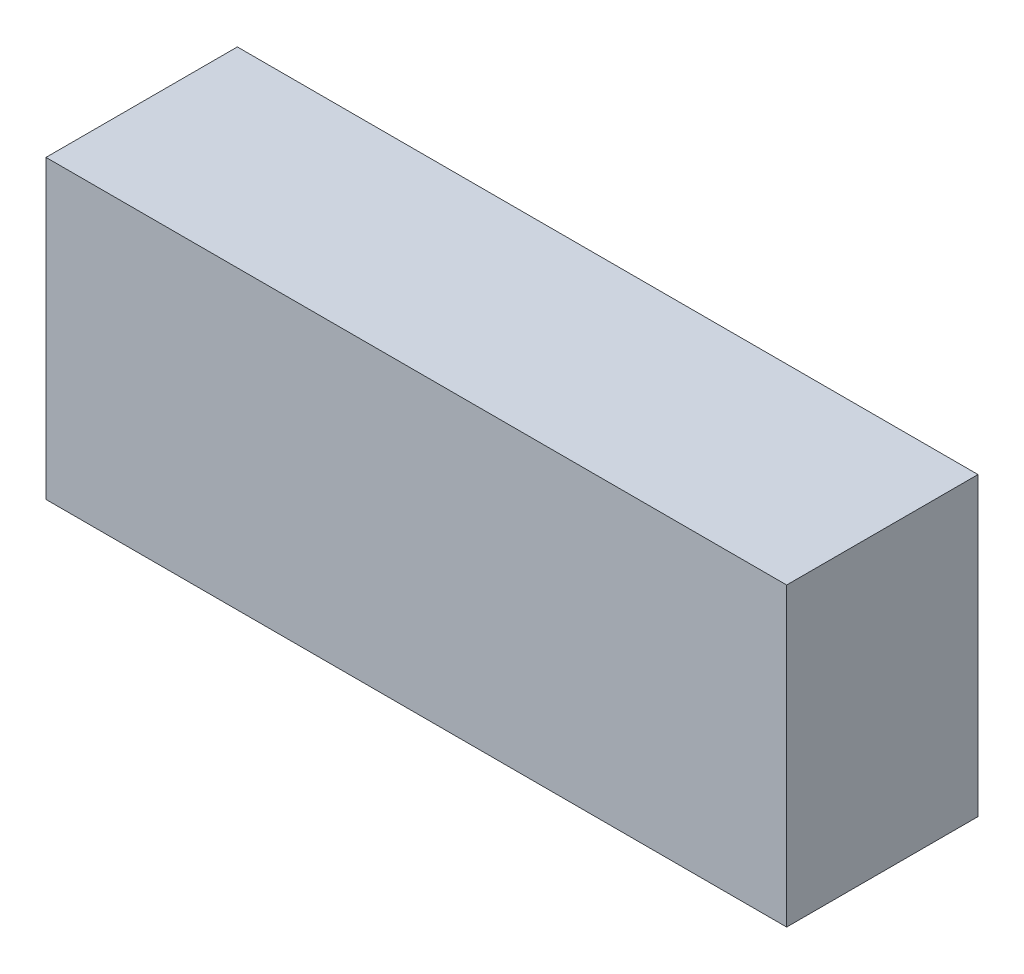
ISO-10303-21;
HEADER;
FILE_DESCRIPTION(('STEP AP214'),'2;1');
FILE_NAME('part.step','',(''),(''),'','','');
FILE_SCHEMA(('AUTOMOTIVE_DESIGN { 1 0 10303 214 1 1 1 1 }'));
ENDSEC;
DATA;
#1=APPLICATION_CONTEXT('core data for automotive mechanical design processes');
#2=APPLICATION_PROTOCOL_DEFINITION('international standard','automotive_design',2000,#1);
#3=PRODUCT_CONTEXT('',#1,'mechanical');
#4=PRODUCT('Part','Part','',(#3));
#5=PRODUCT_RELATED_PRODUCT_CATEGORY('part','',(#4));
#6=PRODUCT_DEFINITION_FORMATION('','',#4);
#7=PRODUCT_DEFINITION_CONTEXT('part definition',#1,'design');
#8=PRODUCT_DEFINITION('design','',#6,#7);
#9=PRODUCT_DEFINITION_SHAPE('','',#8);
#10=(LENGTH_UNIT() NAMED_UNIT(*) SI_UNIT(.MILLI.,.METRE.));
#11=(NAMED_UNIT(*) PLANE_ANGLE_UNIT() SI_UNIT($,.RADIAN.));
#12=(NAMED_UNIT(*) SI_UNIT($,.STERADIAN.) SOLID_ANGLE_UNIT());
#13=UNCERTAINTY_MEASURE_WITH_UNIT(LENGTH_MEASURE(1.E-05),#10,'distance_accuracy_value','');
#14=(GEOMETRIC_REPRESENTATION_CONTEXT(3) GLOBAL_UNCERTAINTY_ASSIGNED_CONTEXT((#13)) GLOBAL_UNIT_ASSIGNED_CONTEXT((#10,
#11,#12)) REPRESENTATION_CONTEXT('',''));
#15=CARTESIAN_POINT('',(0.,0.,0.));
#16=DIRECTION('',(0.,0.,1.));
#17=DIRECTION('',(1.,0.,0.));
#18=AXIS2_PLACEMENT_3D('',#15,#16,#17);
#19=CARTESIAN_POINT('',(-0.9,1.04,0.31));
#20=DIRECTION('',(0.,0.,1.));
#21=DIRECTION('',(1.,0.,0.));
#22=AXIS2_PLACEMENT_3D('',#19,#20,#21);
#23=PLANE('',#22);
#24=DIRECTION('',(1.,0.,0.));
#25=VECTOR('',#24,1.);
#26=CARTESIAN_POINT('',(-0.9,0.56,0.31));
#27=LINE('',#26,#25);
#28=CARTESIAN_POINT('',(0.3,0.56,0.31));
#29=VERTEX_POINT('',#28);
#30=CARTESIAN_POINT('',(-0.9,0.56,0.31));
#31=VERTEX_POINT('',#30);
#32=EDGE_CURVE('E76',#29,#31,#27,.F.);
#33=ORIENTED_EDGE('',*,*,#32,.F.);
#34=DIRECTION('',(0.,1.,0.));
#35=VECTOR('',#34,1.);
#36=CARTESIAN_POINT('',(0.3,1.04,0.31));
#37=LINE('',#36,#35);
#38=CARTESIAN_POINT('',(0.3,1.04,0.31));
#39=VERTEX_POINT('',#38);
#40=EDGE_CURVE('E58',#39,#29,#37,.F.);
#41=ORIENTED_EDGE('',*,*,#40,.F.);
#42=DIRECTION('',(1.,0.,0.));
#43=VECTOR('',#42,1.);
#44=CARTESIAN_POINT('',(-0.9,1.04,0.31));
#45=LINE('',#44,#43);
#46=CARTESIAN_POINT('',(-0.9,1.04,0.31));
#47=VERTEX_POINT('',#46);
#48=EDGE_CURVE('E20',#39,#47,#45,.F.);
#49=ORIENTED_EDGE('',*,*,#48,.T.);
#50=DIRECTION('',(0.,1.,0.));
#51=VECTOR('',#50,1.);
#52=CARTESIAN_POINT('',(-0.9,1.04,0.31));
#53=LINE('',#52,#51);
#54=EDGE_CURVE('E55',#47,#31,#53,.F.);
#55=ORIENTED_EDGE('',*,*,#54,.T.);
#56=EDGE_LOOP('',(#33,#41,#49,#55));
#57=FACE_BOUND('',#56,.T.);
#58=ADVANCED_FACE('F17',(#57),#23,.T.);
#59=CARTESIAN_POINT('',(-0.9,1.04,0.));
#60=DIRECTION('',(0.,-1.,0.));
#61=DIRECTION('',(1.,0.,0.));
#62=AXIS2_PLACEMENT_3D('',#59,#60,#61);
#63=PLANE('',#62);
#64=DIRECTION('',(0.,0.,1.));
#65=VECTOR('',#64,1.);
#66=CARTESIAN_POINT('',(0.3,1.04,0.));
#67=LINE('',#66,#65);
#68=CARTESIAN_POINT('',(0.3,1.04,0.));
#69=VERTEX_POINT('',#68);
#70=EDGE_CURVE('E78',#69,#39,#67,.T.);
#71=ORIENTED_EDGE('',*,*,#70,.F.);
#72=DIRECTION('',(1.,0.,0.));
#73=VECTOR('',#72,1.);
#74=CARTESIAN_POINT('',(-0.9,1.04,0.));
#75=LINE('',#74,#73);
#76=CARTESIAN_POINT('',(-0.9,1.04,0.));
#77=VERTEX_POINT('',#76);
#78=EDGE_CURVE('E73',#69,#77,#75,.F.);
#79=ORIENTED_EDGE('',*,*,#78,.T.);
#80=DIRECTION('',(0.,0.,1.));
#81=VECTOR('',#80,1.);
#82=CARTESIAN_POINT('',(-0.9,1.04,0.));
#83=LINE('',#82,#81);
#84=EDGE_CURVE('E63',#77,#47,#83,.T.);
#85=ORIENTED_EDGE('',*,*,#84,.T.);
#86=ORIENTED_EDGE('',*,*,#48,.F.);
#87=EDGE_LOOP('',(#71,#79,#85,#86));
#88=FACE_BOUND('',#87,.T.);
#89=ADVANCED_FACE('F72',(#88),#63,.F.);
#90=CARTESIAN_POINT('',(-0.9,1.04,0.));
#91=DIRECTION('',(1.,0.,0.));
#92=DIRECTION('',(0.,1.,0.));
#93=AXIS2_PLACEMENT_3D('',#90,#91,#92);
#94=PLANE('',#93);
#95=ORIENTED_EDGE('',*,*,#54,.F.);
#96=ORIENTED_EDGE('',*,*,#84,.F.);
#97=DIRECTION('',(0.,1.,0.));
#98=VECTOR('',#97,1.);
#99=CARTESIAN_POINT('',(-0.9,1.04,0.));
#100=LINE('',#99,#98);
#101=CARTESIAN_POINT('',(-0.9,0.56,0.));
#102=VERTEX_POINT('',#101);
#103=EDGE_CURVE('E83',#77,#102,#100,.F.);
#104=ORIENTED_EDGE('',*,*,#103,.T.);
#105=DIRECTION('',(0.,0.,1.));
#106=VECTOR('',#105,1.);
#107=CARTESIAN_POINT('',(-0.9,0.56,0.));
#108=LINE('',#107,#106);
#109=EDGE_CURVE('E69',#31,#102,#108,.F.);
#110=ORIENTED_EDGE('',*,*,#109,.F.);
#111=EDGE_LOOP('',(#95,#96,#104,#110));
#112=FACE_BOUND('',#111,.T.);
#113=ADVANCED_FACE('F66',(#112),#94,.F.);
#114=CARTESIAN_POINT('',(-0.9,0.56,0.));
#115=DIRECTION('',(0.,-1.,0.));
#116=DIRECTION('',(1.,0.,0.));
#117=AXIS2_PLACEMENT_3D('',#114,#115,#116);
#118=PLANE('',#117);
#119=DIRECTION('',(0.,0.,1.));
#120=VECTOR('',#119,1.);
#121=CARTESIAN_POINT('',(0.3,0.56,0.));
#122=LINE('',#121,#120);
#123=CARTESIAN_POINT('',(0.3,0.56,0.));
#124=VERTEX_POINT('',#123);
#125=EDGE_CURVE('E34',#29,#124,#122,.F.);
#126=ORIENTED_EDGE('',*,*,#125,.F.);
#127=ORIENTED_EDGE('',*,*,#32,.T.);
#128=ORIENTED_EDGE('',*,*,#109,.T.);
#129=DIRECTION('',(1.,0.,0.));
#130=VECTOR('',#129,1.);
#131=CARTESIAN_POINT('',(-0.9,0.56,0.));
#132=LINE('',#131,#130);
#133=EDGE_CURVE('E26',#102,#124,#132,.T.);
#134=ORIENTED_EDGE('',*,*,#133,.T.);
#135=EDGE_LOOP('',(#126,#127,#128,#134));
#136=FACE_BOUND('',#135,.T.);
#137=ADVANCED_FACE('F88',(#136),#118,.T.);
#138=CARTESIAN_POINT('',(0.3,1.04,0.));
#139=DIRECTION('',(1.,0.,0.));
#140=DIRECTION('',(0.,1.,0.));
#141=AXIS2_PLACEMENT_3D('',#138,#139,#140);
#142=PLANE('',#141);
#143=ORIENTED_EDGE('',*,*,#40,.T.);
#144=ORIENTED_EDGE('',*,*,#125,.T.);
#145=DIRECTION('',(0.,1.,0.));
#146=VECTOR('',#145,1.);
#147=CARTESIAN_POINT('',(0.3,1.04,0.));
#148=LINE('',#147,#146);
#149=EDGE_CURVE('E11',#124,#69,#148,.T.);
#150=ORIENTED_EDGE('',*,*,#149,.T.);
#151=ORIENTED_EDGE('',*,*,#70,.T.);
#152=EDGE_LOOP('',(#143,#144,#150,#151));
#153=FACE_BOUND('',#152,.T.);
#154=ADVANCED_FACE('F91',(#153),#142,.T.);
#155=CARTESIAN_POINT('',(-0.9,1.04,0.));
#156=DIRECTION('',(0.,0.,1.));
#157=DIRECTION('',(1.,0.,0.));
#158=AXIS2_PLACEMENT_3D('',#155,#156,#157);
#159=PLANE('',#158);
#160=ORIENTED_EDGE('',*,*,#133,.F.);
#161=ORIENTED_EDGE('',*,*,#103,.F.);
#162=ORIENTED_EDGE('',*,*,#78,.F.);
#163=ORIENTED_EDGE('',*,*,#149,.F.);
#164=EDGE_LOOP('',(#160,#161,#162,#163));
#165=FACE_BOUND('',#164,.T.);
#166=ADVANCED_FACE('F90',(#165),#159,.F.);
#167=CLOSED_SHELL('',(#58,#89,#113,#137,#154,#166));
#168=MANIFOLD_SOLID_BREP('B1',#167);
#169=ADVANCED_BREP_SHAPE_REPRESENTATION('',(#18,#168),#14);
#170=SHAPE_DEFINITION_REPRESENTATION(#9,#169);
ENDSEC;
END-ISO-10303-21;
